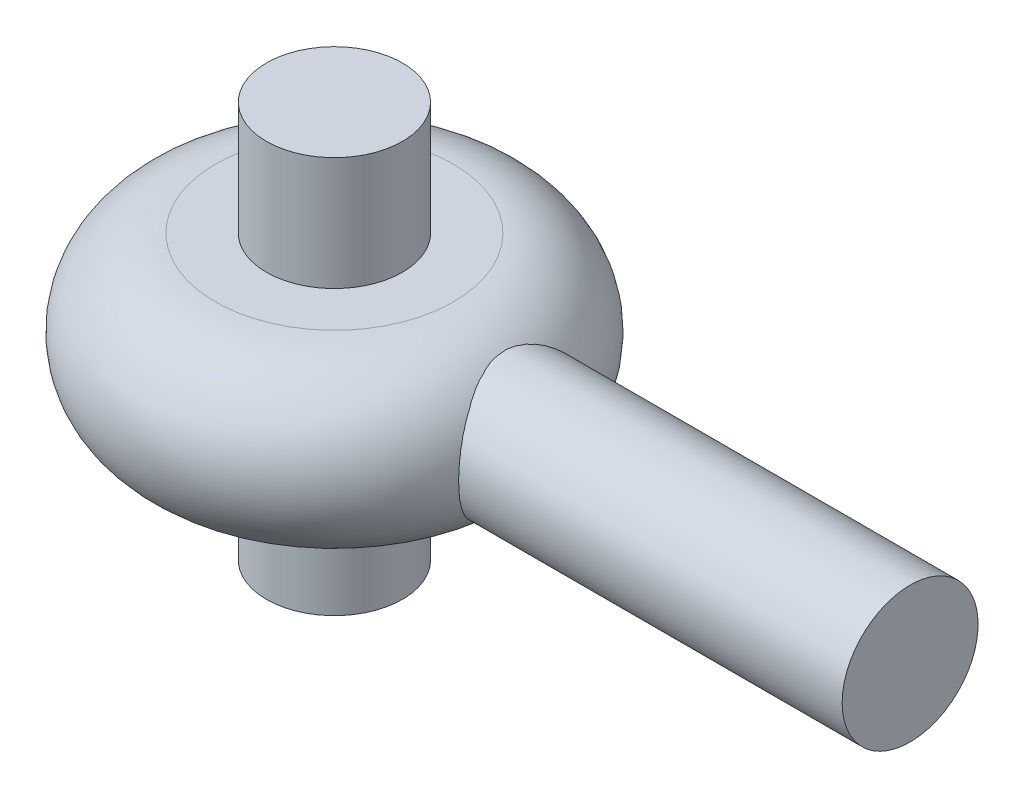
ISO-10303-21;
HEADER;
FILE_DESCRIPTION(('STEP AP214'),'2;1');
FILE_NAME('part.step','',(''),(''),'','','');
FILE_SCHEMA(('AUTOMOTIVE_DESIGN { 1 0 10303 214 1 1 1 1 }'));
ENDSEC;
DATA;
#1=APPLICATION_CONTEXT('core data for automotive mechanical design processes');
#2=APPLICATION_PROTOCOL_DEFINITION('international standard','automotive_design',2000,#1);
#3=PRODUCT_CONTEXT('',#1,'mechanical');
#4=PRODUCT('Part','Part','',(#3));
#5=PRODUCT_RELATED_PRODUCT_CATEGORY('part','',(#4));
#6=PRODUCT_DEFINITION_FORMATION('','',#4);
#7=PRODUCT_DEFINITION_CONTEXT('part definition',#1,'design');
#8=PRODUCT_DEFINITION('design','',#6,#7);
#9=PRODUCT_DEFINITION_SHAPE('','',#8);
#10=(LENGTH_UNIT() NAMED_UNIT(*) SI_UNIT(.MILLI.,.METRE.));
#11=(NAMED_UNIT(*) PLANE_ANGLE_UNIT() SI_UNIT($,.RADIAN.));
#12=(NAMED_UNIT(*) SI_UNIT($,.STERADIAN.) SOLID_ANGLE_UNIT());
#13=UNCERTAINTY_MEASURE_WITH_UNIT(LENGTH_MEASURE(1.E-05),#10,'distance_accuracy_value','');
#14=(GEOMETRIC_REPRESENTATION_CONTEXT(3) GLOBAL_UNCERTAINTY_ASSIGNED_CONTEXT((#13)) GLOBAL_UNIT_ASSIGNED_CONTEXT((#10,
#11,#12)) REPRESENTATION_CONTEXT('',''));
#15=CARTESIAN_POINT('',(0.,0.,0.));
#16=DIRECTION('',(0.,0.,1.));
#17=DIRECTION('',(1.,0.,0.));
#18=AXIS2_PLACEMENT_3D('',#15,#16,#17);
#19=CARTESIAN_POINT('',(0.,-17.5,0.));
#20=DIRECTION('',(0.,1.,0.));
#21=DIRECTION('',(0.,0.,1.));
#22=AXIS2_PLACEMENT_3D('',#19,#20,#21);
#23=CYLINDRICAL_SURFACE('',#22,6.);
#24=CARTESIAN_POINT('',(0.,-17.5,0.));
#25=DIRECTION('',(0.,1.,0.));
#26=DIRECTION('',(0.,0.,1.));
#27=AXIS2_PLACEMENT_3D('',#24,#25,#26);
#28=CIRCLE('',#27,6.);
#29=CARTESIAN_POINT('',(0.,-17.5,6.));
#30=VERTEX_POINT('',#29);
#31=EDGE_CURVE('E12',#30,#30,#28,.T.);
#32=ORIENTED_EDGE('',*,*,#31,.T.);
#33=EDGE_LOOP('',(#32));
#34=FACE_BOUND('',#33,.T.);
#35=CARTESIAN_POINT('',(0.,17.5,0.));
#36=DIRECTION('',(0.,1.,0.));
#37=DIRECTION('',(0.,0.,1.));
#38=AXIS2_PLACEMENT_3D('',#35,#36,#37);
#39=CIRCLE('',#38,6.);
#40=CARTESIAN_POINT('',(0.,17.5,6.));
#41=VERTEX_POINT('',#40);
#42=EDGE_CURVE('E58',#41,#41,#39,.T.);
#43=ORIENTED_EDGE('',*,*,#42,.F.);
#44=EDGE_LOOP('',(#43));
#45=FACE_BOUND('',#44,.T.);
#46=ADVANCED_FACE('F52',(#34,#45),#23,.T.);
#47=CARTESIAN_POINT('',(0.,-17.5,0.));
#48=DIRECTION('',(0.,1.,0.));
#49=DIRECTION('',(0.,0.,1.));
#50=AXIS2_PLACEMENT_3D('',#47,#48,#49);
#51=PLANE('',#50);
#52=ORIENTED_EDGE('',*,*,#31,.F.);
#53=EDGE_LOOP('',(#52));
#54=FACE_BOUND('',#53,.T.);
#55=ADVANCED_FACE('F67',(#54),#51,.F.);
#56=CARTESIAN_POINT('',(0.,17.5,0.));
#57=DIRECTION('',(0.,1.,0.));
#58=DIRECTION('',(0.,0.,1.));
#59=AXIS2_PLACEMENT_3D('',#56,#57,#58);
#60=PLANE('',#59);
#61=ORIENTED_EDGE('',*,*,#42,.T.);
#62=EDGE_LOOP('',(#61));
#63=FACE_BOUND('',#62,.T.);
#64=ADVANCED_FACE('F64',(#63),#60,.T.);
#65=CLOSED_SHELL('',(#46,#55,#64));
#66=MANIFOLD_SOLID_BREP('B2',#65);
#67=CARTESIAN_POINT('',(10.0162849116581,0.,0.));
#68=DIRECTION('',(1.,0.,0.));
#69=DIRECTION('',(0.,0.,-1.));
#70=AXIS2_PLACEMENT_3D('',#67,#68,#69);
#71=CYLINDRICAL_SURFACE('',#70,6.);
#72=CARTESIAN_POINT('',(10.0162849116581,0.,0.));
#73=DIRECTION('',(-1.,0.,0.));
#74=DIRECTION('',(0.,0.,1.));
#75=AXIS2_PLACEMENT_3D('',#72,#73,#74);
#76=CIRCLE('',#75,6.);
#77=CARTESIAN_POINT('',(10.0162849116581,0.,6.));
#78=VERTEX_POINT('',#77);
#79=EDGE_CURVE('E51',#78,#78,#76,.T.);
#80=ORIENTED_EDGE('',*,*,#79,.F.);
#81=EDGE_LOOP('',(#80));
#82=FACE_BOUND('',#81,.T.);
#83=CARTESIAN_POINT('',(50.8,0.,0.));
#84=DIRECTION('',(-1.,0.,0.));
#85=DIRECTION('',(0.,0.,1.));
#86=AXIS2_PLACEMENT_3D('',#83,#84,#85);
#87=CIRCLE('',#86,6.);
#88=CARTESIAN_POINT('',(50.8,0.,6.));
#89=VERTEX_POINT('',#88);
#90=EDGE_CURVE('E102',#89,#89,#87,.T.);
#91=ORIENTED_EDGE('',*,*,#90,.T.);
#92=EDGE_LOOP('',(#91));
#93=FACE_BOUND('',#92,.T.);
#94=ADVANCED_FACE('F99',(#82,#93),#71,.T.);
#95=CARTESIAN_POINT('',(10.0162849116581,0.,0.));
#96=DIRECTION('',(-1.,0.,0.));
#97=DIRECTION('',(0.,0.,1.));
#98=AXIS2_PLACEMENT_3D('',#95,#96,#97);
#99=PLANE('',#98);
#100=ORIENTED_EDGE('',*,*,#79,.T.);
#101=EDGE_LOOP('',(#100));
#102=FACE_BOUND('',#101,.T.);
#103=ADVANCED_FACE('F114',(#102),#99,.T.);
#104=CARTESIAN_POINT('',(50.8,0.,0.));
#105=DIRECTION('',(-1.,0.,0.));
#106=DIRECTION('',(0.,0.,1.));
#107=AXIS2_PLACEMENT_3D('',#104,#105,#106);
#108=PLANE('',#107);
#109=ORIENTED_EDGE('',*,*,#90,.F.);
#110=EDGE_LOOP('',(#109));
#111=FACE_BOUND('',#110,.T.);
#112=ADVANCED_FACE('F112',(#111),#108,.F.);
#113=CLOSED_SHELL('',(#94,#103,#112));
#114=MANIFOLD_SOLID_BREP('B7',#113);
#115=CARTESIAN_POINT('',(0.,0.,0.));
#116=DIRECTION('',(0.,-1.,0.));
#117=DIRECTION('',(0.,0.,-1.));
#118=AXIS2_PLACEMENT_3D('',#115,#116,#117);
#119=CYLINDRICAL_SURFACE('',#118,6.);
#120=CARTESIAN_POINT('',(0.,-7.5,0.));
#121=DIRECTION('',(0.,-1.,0.));
#122=DIRECTION('',(0.,0.,-1.));
#123=AXIS2_PLACEMENT_3D('',#120,#121,#122);
#124=CIRCLE('',#123,6.);
#125=CARTESIAN_POINT('',(0.,-7.5,-6.));
#126=VERTEX_POINT('',#125);
#127=EDGE_CURVE('E159',#126,#126,#124,.T.);
#128=ORIENTED_EDGE('',*,*,#127,.T.);
#129=EDGE_LOOP('',(#128));
#130=FACE_BOUND('',#129,.T.);
#131=CARTESIAN_POINT('',(0.,7.5,0.));
#132=DIRECTION('',(0.,-1.,0.));
#133=DIRECTION('',(0.,0.,-1.));
#134=AXIS2_PLACEMENT_3D('',#131,#132,#133);
#135=CIRCLE('',#134,6.);
#136=CARTESIAN_POINT('',(0.,7.5,-6.));
#137=VERTEX_POINT('',#136);
#138=EDGE_CURVE('E98',#137,#137,#135,.T.);
#139=ORIENTED_EDGE('',*,*,#138,.F.);
#140=EDGE_LOOP('',(#139));
#141=FACE_BOUND('',#140,.T.);
#142=ADVANCED_FACE('F145',(#130,#141),#119,.F.);
#143=CARTESIAN_POINT('',(0.,7.5,-6.));
#144=DIRECTION('',(0.,1.,0.));
#145=DIRECTION('',(0.,0.,1.));
#146=AXIS2_PLACEMENT_3D('',#143,#144,#145);
#147=PLANE('',#146);
#148=ORIENTED_EDGE('',*,*,#138,.T.);
#149=EDGE_LOOP('',(#148));
#150=FACE_BOUND('',#149,.T.);
#151=CARTESIAN_POINT('',(0.,7.5,0.));
#152=DIRECTION('',(0.,-1.,0.));
#153=DIRECTION('',(0.,0.,-1.));
#154=AXIS2_PLACEMENT_3D('',#151,#152,#153);
#155=CIRCLE('',#154,10.5165012583575);
#156=CARTESIAN_POINT('',(0.,7.5,-10.5165012583575));
#157=VERTEX_POINT('',#156);
#158=EDGE_CURVE('E151',#157,#157,#155,.T.);
#159=ORIENTED_EDGE('',*,*,#158,.F.);
#160=EDGE_LOOP('',(#159));
#161=FACE_BOUND('',#160,.T.);
#162=ADVANCED_FACE('F175',(#150,#161),#147,.T.);
#163=CARTESIAN_POINT('',(0.,0.,0.));
#164=DIRECTION('',(0.,-1.,0.));
#165=DIRECTION('',(0.,0.,-1.));
#166=AXIS2_PLACEMENT_3D('',#163,#164,#165);
#167=TOROIDAL_SURFACE('',#166,10.5165012583575,7.5);
#168=ORIENTED_EDGE('',*,*,#158,.T.);
#169=EDGE_LOOP('',(#168));
#170=FACE_BOUND('',#169,.T.);
#171=CARTESIAN_POINT('',(0.,-7.5,0.));
#172=DIRECTION('',(0.,-1.,0.));
#173=DIRECTION('',(0.,0.,-1.));
#174=AXIS2_PLACEMENT_3D('',#171,#172,#173);
#175=CIRCLE('',#174,10.5165012583575);
#176=CARTESIAN_POINT('',(0.,-7.5,-10.5165012583575));
#177=VERTEX_POINT('',#176);
#178=EDGE_CURVE('E155',#177,#177,#175,.T.);
#179=ORIENTED_EDGE('',*,*,#178,.F.);
#180=EDGE_LOOP('',(#179));
#181=FACE_BOUND('',#180,.T.);
#182=ADVANCED_FACE('F169',(#170,#181),#167,.T.);
#183=CARTESIAN_POINT('',(0.,-7.5,-6.));
#184=DIRECTION('',(0.,-1.,0.));
#185=DIRECTION('',(0.,0.,-1.));
#186=AXIS2_PLACEMENT_3D('',#183,#184,#185);
#187=PLANE('',#186);
#188=ORIENTED_EDGE('',*,*,#178,.T.);
#189=EDGE_LOOP('',(#188));
#190=FACE_BOUND('',#189,.T.);
#191=ORIENTED_EDGE('',*,*,#127,.F.);
#192=EDGE_LOOP('',(#191));
#193=FACE_BOUND('',#192,.T.);
#194=ADVANCED_FACE('F167',(#190,#193),#187,.T.);
#195=CLOSED_SHELL('',(#142,#162,#182,#194));
#196=MANIFOLD_SOLID_BREP('B46',#195);
#197=ADVANCED_BREP_SHAPE_REPRESENTATION('',(#18,#66,#114,#196),#14);
#198=SHAPE_DEFINITION_REPRESENTATION(#9,#197);
ENDSEC;
END-ISO-10303-21;
